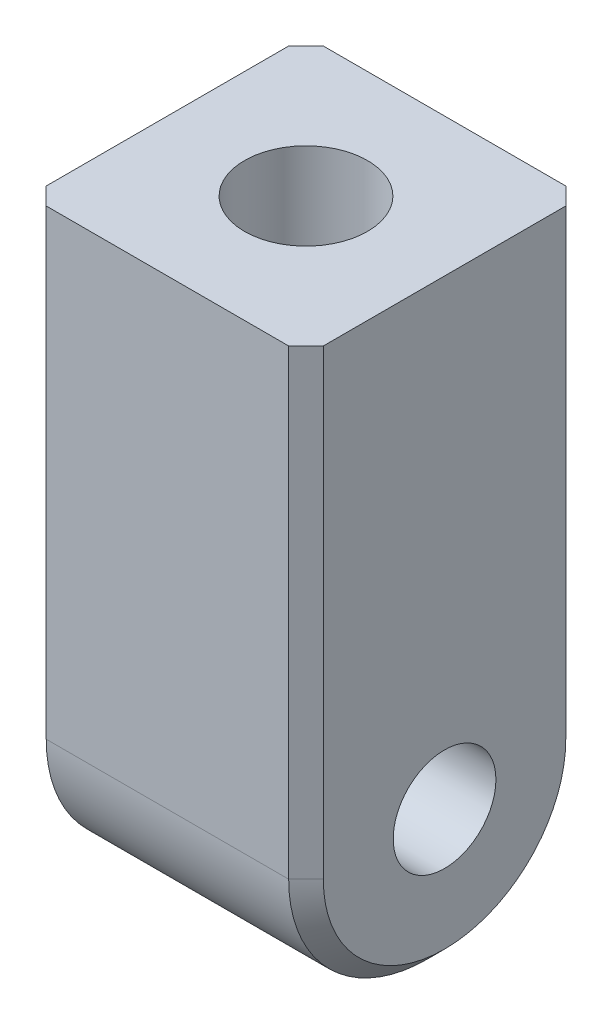
ISO-10303-21;
HEADER;
FILE_DESCRIPTION(('STEP AP214'),'2;1');
FILE_NAME('part.step','',(''),(''),'','','');
FILE_SCHEMA(('AUTOMOTIVE_DESIGN { 1 0 10303 214 1 1 1 1 }'));
ENDSEC;
DATA;
#1=APPLICATION_CONTEXT('core data for automotive mechanical design processes');
#2=APPLICATION_PROTOCOL_DEFINITION('international standard','automotive_design',2000,#1);
#3=PRODUCT_CONTEXT('',#1,'mechanical');
#4=PRODUCT('Part','Part','',(#3));
#5=PRODUCT_RELATED_PRODUCT_CATEGORY('part','',(#4));
#6=PRODUCT_DEFINITION_FORMATION('','',#4);
#7=PRODUCT_DEFINITION_CONTEXT('part definition',#1,'design');
#8=PRODUCT_DEFINITION('design','',#6,#7);
#9=PRODUCT_DEFINITION_SHAPE('','',#8);
#10=(LENGTH_UNIT() NAMED_UNIT(*) SI_UNIT(.MILLI.,.METRE.));
#11=(NAMED_UNIT(*) PLANE_ANGLE_UNIT() SI_UNIT($,.RADIAN.));
#12=(NAMED_UNIT(*) SI_UNIT($,.STERADIAN.) SOLID_ANGLE_UNIT());
#13=UNCERTAINTY_MEASURE_WITH_UNIT(LENGTH_MEASURE(1.E-05),#10,'distance_accuracy_value','');
#14=(GEOMETRIC_REPRESENTATION_CONTEXT(3) GLOBAL_UNCERTAINTY_ASSIGNED_CONTEXT((#13)) GLOBAL_UNIT_ASSIGNED_CONTEXT((#10,
#11,#12)) REPRESENTATION_CONTEXT('',''));
#15=CARTESIAN_POINT('',(0.,0.,0.));
#16=DIRECTION('',(0.,0.,1.));
#17=DIRECTION('',(1.,0.,0.));
#18=AXIS2_PLACEMENT_3D('',#15,#16,#17);
#19=CARTESIAN_POINT('',(3.048,13.208,3.048));
#20=DIRECTION('',(-1.,0.,0.));
#21=DIRECTION('',(0.,0.,1.));
#22=AXIS2_PLACEMENT_3D('',#19,#20,#21);
#23=PLANE('',#22);
#24=CARTESIAN_POINT('',(3.048,3.048,0.));
#25=DIRECTION('',(1.,0.,0.));
#26=DIRECTION('',(0.,0.,-1.));
#27=AXIS2_PLACEMENT_3D('',#24,#25,#26);
#28=CIRCLE('',#27,1.1303);
#29=CARTESIAN_POINT('',(3.048,3.048,-1.1303));
#30=VERTEX_POINT('',#29);
#31=EDGE_CURVE('E204',#30,#30,#28,.T.);
#32=ORIENTED_EDGE('',*,*,#31,.F.);
#33=EDGE_LOOP('',(#32));
#34=FACE_BOUND('',#33,.T.);
#35=CARTESIAN_POINT('',(3.048,3.048,0.));
#36=DIRECTION('',(-1.,0.,0.));
#37=DIRECTION('',(0.,0.,1.));
#38=AXIS2_PLACEMENT_3D('',#35,#36,#37);
#39=CIRCLE('',#38,2.667);
#40=CARTESIAN_POINT('',(3.048,0.381000000000003,0.));
#41=VERTEX_POINT('',#40);
#42=CARTESIAN_POINT('',(3.048,3.048,-2.667));
#43=VERTEX_POINT('',#42);
#44=EDGE_CURVE('E52',#41,#43,#39,.F.);
#45=ORIENTED_EDGE('',*,*,#44,.T.);
#46=DIRECTION('',(0.,1.,0.));
#47=VECTOR('',#46,1.);
#48=CARTESIAN_POINT('',(3.048,13.208,-2.667));
#49=LINE('',#48,#47);
#50=CARTESIAN_POINT('',(3.048,13.208,-2.667));
#51=VERTEX_POINT('',#50);
#52=EDGE_CURVE('E11',#43,#51,#49,.T.);
#53=ORIENTED_EDGE('',*,*,#52,.T.);
#54=DIRECTION('',(0.,0.,-1.));
#55=VECTOR('',#54,1.);
#56=CARTESIAN_POINT('',(3.048,13.208,3.048));
#57=LINE('',#56,#55);
#58=CARTESIAN_POINT('',(3.048,13.208,2.667));
#59=VERTEX_POINT('',#58);
#60=EDGE_CURVE('E134',#59,#51,#57,.T.);
#61=ORIENTED_EDGE('',*,*,#60,.F.);
#62=DIRECTION('',(0.,-1.,0.));
#63=VECTOR('',#62,1.);
#64=CARTESIAN_POINT('',(3.048,13.208,2.667));
#65=LINE('',#64,#63);
#66=CARTESIAN_POINT('',(3.048,3.048,2.667));
#67=VERTEX_POINT('',#66);
#68=EDGE_CURVE('E192',#59,#67,#65,.T.);
#69=ORIENTED_EDGE('',*,*,#68,.T.);
#70=CARTESIAN_POINT('',(3.048,3.048,0.));
#71=DIRECTION('',(-1.,0.,0.));
#72=DIRECTION('',(0.,0.,1.));
#73=AXIS2_PLACEMENT_3D('',#70,#71,#72);
#74=CIRCLE('',#73,2.667);
#75=EDGE_CURVE('E63',#67,#41,#74,.F.);
#76=ORIENTED_EDGE('',*,*,#75,.T.);
#77=EDGE_LOOP('',(#45,#53,#61,#69,#76));
#78=FACE_BOUND('',#77,.T.);
#79=ADVANCED_FACE('F42',(#34,#78),#23,.F.);
#80=CARTESIAN_POINT('',(-3.048,13.208,-3.048));
#81=DIRECTION('',(0.,0.,1.));
#82=DIRECTION('',(1.,0.,0.));
#83=AXIS2_PLACEMENT_3D('',#80,#81,#82);
#84=PLANE('',#83);
#85=DIRECTION('',(-1.,0.,0.));
#86=VECTOR('',#85,1.);
#87=CARTESIAN_POINT('',(-3.048,3.048,-3.048));
#88=LINE('',#87,#86);
#89=CARTESIAN_POINT('',(2.66699999999999,3.048,-3.048));
#90=VERTEX_POINT('',#89);
#91=CARTESIAN_POINT('',(-2.667,3.048,-3.048));
#92=VERTEX_POINT('',#91);
#93=EDGE_CURVE('E152',#90,#92,#88,.T.);
#94=ORIENTED_EDGE('',*,*,#93,.T.);
#95=DIRECTION('',(0.,1.,0.));
#96=VECTOR('',#95,1.);
#97=CARTESIAN_POINT('',(-2.667,13.208,-3.048));
#98=LINE('',#97,#96);
#99=CARTESIAN_POINT('',(-2.667,13.208,-3.048));
#100=VERTEX_POINT('',#99);
#101=EDGE_CURVE('E190',#92,#100,#98,.T.);
#102=ORIENTED_EDGE('',*,*,#101,.T.);
#103=DIRECTION('',(-1.,0.,0.));
#104=VECTOR('',#103,1.);
#105=CARTESIAN_POINT('',(-3.048,13.208,-3.048));
#106=LINE('',#105,#104);
#107=CARTESIAN_POINT('',(2.66699999999999,13.208,-3.048));
#108=VERTEX_POINT('',#107);
#109=EDGE_CURVE('E143',#108,#100,#106,.T.);
#110=ORIENTED_EDGE('',*,*,#109,.F.);
#111=DIRECTION('',(0.,-1.,0.));
#112=VECTOR('',#111,1.);
#113=CARTESIAN_POINT('',(2.66699999999999,13.208,-3.048));
#114=LINE('',#113,#112);
#115=EDGE_CURVE('E187',#108,#90,#114,.T.);
#116=ORIENTED_EDGE('',*,*,#115,.T.);
#117=EDGE_LOOP('',(#94,#102,#110,#116));
#118=FACE_BOUND('',#117,.T.);
#119=ADVANCED_FACE('F257',(#118),#84,.F.);
#120=CARTESIAN_POINT('',(-3.048,13.208,3.048));
#121=DIRECTION('',(1.,0.,0.));
#122=DIRECTION('',(0.,0.,-1.));
#123=AXIS2_PLACEMENT_3D('',#120,#121,#122);
#124=PLANE('',#123);
#125=CARTESIAN_POINT('',(-3.048,3.048,0.));
#126=DIRECTION('',(1.,0.,0.));
#127=DIRECTION('',(0.,0.,-1.));
#128=AXIS2_PLACEMENT_3D('',#125,#126,#127);
#129=CIRCLE('',#128,1.1303);
#130=CARTESIAN_POINT('',(-3.048,3.048,-1.1303));
#131=VERTEX_POINT('',#130);
#132=EDGE_CURVE('E137',#131,#131,#129,.T.);
#133=ORIENTED_EDGE('',*,*,#132,.T.);
#134=EDGE_LOOP('',(#133));
#135=FACE_BOUND('',#134,.T.);
#136=CARTESIAN_POINT('',(-3.048,3.048,0.));
#137=DIRECTION('',(1.,0.,0.));
#138=DIRECTION('',(0.,0.,-1.));
#139=AXIS2_PLACEMENT_3D('',#136,#137,#138);
#140=CIRCLE('',#139,2.667);
#141=CARTESIAN_POINT('',(-3.048,0.381000000000002,0.));
#142=VERTEX_POINT('',#141);
#143=CARTESIAN_POINT('',(-3.048,3.048,2.667));
#144=VERTEX_POINT('',#143);
#145=EDGE_CURVE('E167',#142,#144,#140,.F.);
#146=ORIENTED_EDGE('',*,*,#145,.T.);
#147=DIRECTION('',(0.,1.,0.));
#148=VECTOR('',#147,1.);
#149=CARTESIAN_POINT('',(-3.048,13.208,2.667));
#150=LINE('',#149,#148);
#151=CARTESIAN_POINT('',(-3.048,13.208,2.667));
#152=VERTEX_POINT('',#151);
#153=EDGE_CURVE('E169',#144,#152,#150,.T.);
#154=ORIENTED_EDGE('',*,*,#153,.T.);
#155=DIRECTION('',(0.,0.,1.));
#156=VECTOR('',#155,1.);
#157=CARTESIAN_POINT('',(-3.048,13.208,3.048));
#158=LINE('',#157,#156);
#159=CARTESIAN_POINT('',(-3.048,13.208,-2.667));
#160=VERTEX_POINT('',#159);
#161=EDGE_CURVE('E146',#160,#152,#158,.T.);
#162=ORIENTED_EDGE('',*,*,#161,.F.);
#163=DIRECTION('',(0.,-1.,0.));
#164=VECTOR('',#163,1.);
#165=CARTESIAN_POINT('',(-3.048,13.208,-2.667));
#166=LINE('',#165,#164);
#167=CARTESIAN_POINT('',(-3.048,3.048,-2.667));
#168=VERTEX_POINT('',#167);
#169=EDGE_CURVE('E163',#160,#168,#166,.T.);
#170=ORIENTED_EDGE('',*,*,#169,.T.);
#171=CARTESIAN_POINT('',(-3.048,3.048,0.));
#172=DIRECTION('',(1.,0.,0.));
#173=DIRECTION('',(0.,0.,-1.));
#174=AXIS2_PLACEMENT_3D('',#171,#172,#173);
#175=CIRCLE('',#174,2.667);
#176=EDGE_CURVE('E165',#168,#142,#175,.F.);
#177=ORIENTED_EDGE('',*,*,#176,.T.);
#178=EDGE_LOOP('',(#146,#154,#162,#170,#177));
#179=FACE_BOUND('',#178,.T.);
#180=ADVANCED_FACE('F249',(#135,#179),#124,.F.);
#181=CARTESIAN_POINT('',(-3.048,13.208,3.048));
#182=DIRECTION('',(0.,0.,-1.));
#183=DIRECTION('',(-1.,0.,0.));
#184=AXIS2_PLACEMENT_3D('',#181,#182,#183);
#185=PLANE('',#184);
#186=DIRECTION('',(1.,0.,0.));
#187=VECTOR('',#186,1.);
#188=CARTESIAN_POINT('',(-3.048,13.208,3.048));
#189=LINE('',#188,#187);
#190=CARTESIAN_POINT('',(-2.667,13.208,3.048));
#191=VERTEX_POINT('',#190);
#192=CARTESIAN_POINT('',(2.66699999999999,13.208,3.048));
#193=VERTEX_POINT('',#192);
#194=EDGE_CURVE('E149',#191,#193,#189,.T.);
#195=ORIENTED_EDGE('',*,*,#194,.F.);
#196=DIRECTION('',(0.,-1.,0.));
#197=VECTOR('',#196,1.);
#198=CARTESIAN_POINT('',(-2.667,13.208,3.048));
#199=LINE('',#198,#197);
#200=CARTESIAN_POINT('',(-2.667,3.048,3.048));
#201=VERTEX_POINT('',#200);
#202=EDGE_CURVE('E160',#191,#201,#199,.T.);
#203=ORIENTED_EDGE('',*,*,#202,.T.);
#204=DIRECTION('',(1.,0.,0.));
#205=VECTOR('',#204,1.);
#206=CARTESIAN_POINT('',(3.048,3.048,3.048));
#207=LINE('',#206,#205);
#208=CARTESIAN_POINT('',(2.66699999999999,3.048,3.048));
#209=VERTEX_POINT('',#208);
#210=EDGE_CURVE('E155',#201,#209,#207,.T.);
#211=ORIENTED_EDGE('',*,*,#210,.T.);
#212=DIRECTION('',(0.,1.,0.));
#213=VECTOR('',#212,1.);
#214=CARTESIAN_POINT('',(2.66699999999999,13.208,3.048));
#215=LINE('',#214,#213);
#216=EDGE_CURVE('E157',#209,#193,#215,.T.);
#217=ORIENTED_EDGE('',*,*,#216,.T.);
#218=EDGE_LOOP('',(#195,#203,#211,#217));
#219=FACE_BOUND('',#218,.T.);
#220=ADVANCED_FACE('F221',(#219),#185,.F.);
#221=CARTESIAN_POINT('',(0.,13.208,0.));
#222=DIRECTION('',(0.,-1.,0.));
#223=DIRECTION('',(0.,0.,-1.));
#224=AXIS2_PLACEMENT_3D('',#221,#222,#223);
#225=PLANE('',#224);
#226=CARTESIAN_POINT('',(0.,13.208,0.));
#227=DIRECTION('',(0.,1.,0.));
#228=DIRECTION('',(0.,0.,1.));
#229=AXIS2_PLACEMENT_3D('',#226,#227,#228);
#230=CIRCLE('',#229,1.35255);
#231=CARTESIAN_POINT('',(0.,13.208,1.35255));
#232=VERTEX_POINT('',#231);
#233=EDGE_CURVE('E131',#232,#232,#230,.T.);
#234=ORIENTED_EDGE('',*,*,#233,.F.);
#235=EDGE_LOOP('',(#234));
#236=FACE_BOUND('',#235,.T.);
#237=ORIENTED_EDGE('',*,*,#161,.T.);
#238=DIRECTION('',(-0.707106781186549,0.,-0.707106781186546));
#239=VECTOR('',#238,1.);
#240=CARTESIAN_POINT('',(-2.667,13.208,3.048));
#241=LINE('',#240,#239);
#242=EDGE_CURVE('E177',#152,#191,#241,.F.);
#243=ORIENTED_EDGE('',*,*,#242,.T.);
#244=ORIENTED_EDGE('',*,*,#194,.T.);
#245=DIRECTION('',(-0.707106781186549,0.,0.707106781186546));
#246=VECTOR('',#245,1.);
#247=CARTESIAN_POINT('',(3.048,13.208,2.667));
#248=LINE('',#247,#246);
#249=EDGE_CURVE('E171',#193,#59,#248,.F.);
#250=ORIENTED_EDGE('',*,*,#249,.T.);
#251=ORIENTED_EDGE('',*,*,#60,.T.);
#252=DIRECTION('',(0.707106781186549,0.,0.707106781186546));
#253=VECTOR('',#252,1.);
#254=CARTESIAN_POINT('',(2.66699999999999,13.208,-3.048));
#255=LINE('',#254,#253);
#256=EDGE_CURVE('E173',#51,#108,#255,.F.);
#257=ORIENTED_EDGE('',*,*,#256,.T.);
#258=ORIENTED_EDGE('',*,*,#109,.T.);
#259=DIRECTION('',(0.707106781186549,0.,-0.707106781186546));
#260=VECTOR('',#259,1.);
#261=CARTESIAN_POINT('',(-3.048,13.208,-2.667));
#262=LINE('',#261,#260);
#263=EDGE_CURVE('E175',#100,#160,#262,.F.);
#264=ORIENTED_EDGE('',*,*,#263,.T.);
#265=EDGE_LOOP('',(#237,#243,#244,#250,#251,#257,#258,#264));
#266=FACE_BOUND('',#265,.T.);
#267=ADVANCED_FACE('F225',(#236,#266),#225,.F.);
#268=CARTESIAN_POINT('',(-3.048,3.048,0.));
#269=DIRECTION('',(-1.,0.,0.));
#270=DIRECTION('',(0.,0.,1.));
#271=AXIS2_PLACEMENT_3D('',#268,#269,#270);
#272=CYLINDRICAL_SURFACE('',#271,3.048);
#273=ORIENTED_EDGE('',*,*,#210,.F.);
#274=CARTESIAN_POINT('',(-2.667,3.048,0.));
#275=DIRECTION('',(1.,0.,0.));
#276=DIRECTION('',(0.,0.,-1.));
#277=AXIS2_PLACEMENT_3D('',#274,#275,#276);
#278=CIRCLE('',#277,3.048);
#279=CARTESIAN_POINT('',(-2.667,0.,0.));
#280=VERTEX_POINT('',#279);
#281=EDGE_CURVE('E181',#201,#280,#278,.T.);
#282=ORIENTED_EDGE('',*,*,#281,.T.);
#283=DIRECTION('',(1.,0.,0.));
#284=VECTOR('',#283,1.);
#285=CARTESIAN_POINT('',(-3.048,0.,0.));
#286=LINE('',#285,#284);
#287=CARTESIAN_POINT('',(2.66699999999999,0.,0.));
#288=VERTEX_POINT('',#287);
#289=EDGE_CURVE('E130',#288,#280,#286,.F.);
#290=ORIENTED_EDGE('',*,*,#289,.F.);
#291=CARTESIAN_POINT('',(2.66699999999999,3.048,0.));
#292=DIRECTION('',(-1.,0.,0.));
#293=DIRECTION('',(0.,0.,1.));
#294=AXIS2_PLACEMENT_3D('',#291,#292,#293);
#295=CIRCLE('',#294,3.048);
#296=EDGE_CURVE('E179',#288,#209,#295,.T.);
#297=ORIENTED_EDGE('',*,*,#296,.T.);
#298=EDGE_LOOP('',(#273,#282,#290,#297));
#299=FACE_BOUND('',#298,.T.);
#300=ADVANCED_FACE('F235',(#299),#272,.T.);
#301=CARTESIAN_POINT('',(-3.048,3.048,0.));
#302=DIRECTION('',(1.,0.,0.));
#303=DIRECTION('',(0.,0.,-1.));
#304=AXIS2_PLACEMENT_3D('',#301,#302,#303);
#305=CYLINDRICAL_SURFACE('',#304,3.048);
#306=ORIENTED_EDGE('',*,*,#289,.T.);
#307=CARTESIAN_POINT('',(-2.667,3.048,0.));
#308=DIRECTION('',(1.,0.,0.));
#309=DIRECTION('',(0.,0.,-1.));
#310=AXIS2_PLACEMENT_3D('',#307,#308,#309);
#311=CIRCLE('',#310,3.048);
#312=EDGE_CURVE('E185',#280,#92,#311,.T.);
#313=ORIENTED_EDGE('',*,*,#312,.T.);
#314=ORIENTED_EDGE('',*,*,#93,.F.);
#315=CARTESIAN_POINT('',(2.66699999999999,3.048,0.));
#316=DIRECTION('',(-1.,0.,0.));
#317=DIRECTION('',(0.,0.,1.));
#318=AXIS2_PLACEMENT_3D('',#315,#316,#317);
#319=CIRCLE('',#318,3.048);
#320=EDGE_CURVE('E183',#90,#288,#319,.T.);
#321=ORIENTED_EDGE('',*,*,#320,.T.);
#322=EDGE_LOOP('',(#306,#313,#314,#321));
#323=FACE_BOUND('',#322,.T.);
#324=ADVANCED_FACE('F124',(#323),#305,.T.);
#325=CARTESIAN_POINT('',(0.,5.588,0.));
#326=DIRECTION('',(0.,1.,0.));
#327=DIRECTION('',(0.,0.,1.));
#328=AXIS2_PLACEMENT_3D('',#325,#326,#327);
#329=CONICAL_SURFACE('',#328,1.35255,1.02974425867665);
#330=CARTESIAN_POINT('',(0.,4.77530596973427,0.));
#331=VERTEX_POINT('',#330);
#332=VERTEX_LOOP('',#331);
#333=FACE_BOUND('',#332,.T.);
#334=CARTESIAN_POINT('',(0.,5.588,0.));
#335=DIRECTION('',(0.,1.,0.));
#336=DIRECTION('',(0.,0.,1.));
#337=AXIS2_PLACEMENT_3D('',#334,#335,#336);
#338=CIRCLE('',#337,1.35255);
#339=CARTESIAN_POINT('',(0.,5.588,1.35255));
#340=VERTEX_POINT('',#339);
#341=EDGE_CURVE('E128',#340,#340,#338,.T.);
#342=ORIENTED_EDGE('',*,*,#341,.T.);
#343=EDGE_LOOP('',(#342));
#344=FACE_BOUND('',#343,.T.);
#345=ADVANCED_FACE('F120',(#333,#344),#329,.F.);
#346=CARTESIAN_POINT('',(0.,13.208,0.));
#347=DIRECTION('',(0.,1.,0.));
#348=DIRECTION('',(0.,0.,1.));
#349=AXIS2_PLACEMENT_3D('',#346,#347,#348);
#350=CYLINDRICAL_SURFACE('',#349,1.35255);
#351=ORIENTED_EDGE('',*,*,#341,.F.);
#352=EDGE_LOOP('',(#351));
#353=FACE_BOUND('',#352,.T.);
#354=ORIENTED_EDGE('',*,*,#233,.T.);
#355=EDGE_LOOP('',(#354));
#356=FACE_BOUND('',#355,.T.);
#357=ADVANCED_FACE('F123',(#353,#356),#350,.F.);
#358=CARTESIAN_POINT('',(3.048,3.048,0.));
#359=DIRECTION('',(1.,0.,0.));
#360=DIRECTION('',(0.,0.,-1.));
#361=AXIS2_PLACEMENT_3D('',#358,#359,#360);
#362=CYLINDRICAL_SURFACE('',#361,1.1303);
#363=ORIENTED_EDGE('',*,*,#132,.F.);
#364=EDGE_LOOP('',(#363));
#365=FACE_BOUND('',#364,.T.);
#366=ORIENTED_EDGE('',*,*,#31,.T.);
#367=EDGE_LOOP('',(#366));
#368=FACE_BOUND('',#367,.T.);
#369=ADVANCED_FACE('F305',(#365,#368),#362,.F.);
#370=CARTESIAN_POINT('',(-3.048,13.208,-2.667));
#371=DIRECTION('',(0.707106781186546,0.,0.707106781186549));
#372=DIRECTION('',(0.,-1.,0.));
#373=AXIS2_PLACEMENT_3D('',#370,#371,#372);
#374=PLANE('',#373);
#375=ORIENTED_EDGE('',*,*,#263,.F.);
#376=ORIENTED_EDGE('',*,*,#101,.F.);
#377=DIRECTION('',(0.707106781186549,0.,-0.707106781186546));
#378=VECTOR('',#377,1.);
#379=CARTESIAN_POINT('',(-3.048,3.048,-2.667));
#380=LINE('',#379,#378);
#381=EDGE_CURVE('E201',#168,#92,#380,.T.);
#382=ORIENTED_EDGE('',*,*,#381,.F.);
#383=ORIENTED_EDGE('',*,*,#169,.F.);
#384=EDGE_LOOP('',(#375,#376,#382,#383));
#385=FACE_BOUND('',#384,.T.);
#386=ADVANCED_FACE('F254',(#385),#374,.F.);
#387=CARTESIAN_POINT('',(-3.048,3.048,0.));
#388=DIRECTION('',(1.,0.,0.));
#389=DIRECTION('',(0.,0.,-1.));
#390=AXIS2_PLACEMENT_3D('',#387,#388,#389);
#391=CONICAL_SURFACE('',#390,2.667,0.785398163397446);
#392=ORIENTED_EDGE('',*,*,#381,.T.);
#393=ORIENTED_EDGE('',*,*,#312,.F.);
#394=DIRECTION('',(0.707106781186549,-0.707106781186546,0.));
#395=VECTOR('',#394,1.);
#396=CARTESIAN_POINT('',(-3.048,0.381000000000002,0.));
#397=LINE('',#396,#395);
#398=EDGE_CURVE('E198',#142,#280,#397,.T.);
#399=ORIENTED_EDGE('',*,*,#398,.F.);
#400=ORIENTED_EDGE('',*,*,#176,.F.);
#401=EDGE_LOOP('',(#392,#393,#399,#400));
#402=FACE_BOUND('',#401,.T.);
#403=ADVANCED_FACE('F242',(#402),#391,.T.);
#404=CARTESIAN_POINT('',(-3.048,3.048,0.));
#405=DIRECTION('',(1.,0.,0.));
#406=DIRECTION('',(0.,0.,-1.));
#407=AXIS2_PLACEMENT_3D('',#404,#405,#406);
#408=CONICAL_SURFACE('',#407,2.667,0.785398163397446);
#409=ORIENTED_EDGE('',*,*,#398,.T.);
#410=ORIENTED_EDGE('',*,*,#281,.F.);
#411=DIRECTION('',(0.707106781186549,0.,0.707106781186546));
#412=VECTOR('',#411,1.);
#413=CARTESIAN_POINT('',(-3.048,3.048,2.667));
#414=LINE('',#413,#412);
#415=EDGE_CURVE('E196',#144,#201,#414,.T.);
#416=ORIENTED_EDGE('',*,*,#415,.F.);
#417=ORIENTED_EDGE('',*,*,#145,.F.);
#418=EDGE_LOOP('',(#409,#410,#416,#417));
#419=FACE_BOUND('',#418,.T.);
#420=ADVANCED_FACE('F247',(#419),#408,.T.);
#421=CARTESIAN_POINT('',(-2.667,13.208,3.048));
#422=DIRECTION('',(0.707106781186546,0.,-0.707106781186549));
#423=DIRECTION('',(0.,-1.,0.));
#424=AXIS2_PLACEMENT_3D('',#421,#422,#423);
#425=PLANE('',#424);
#426=ORIENTED_EDGE('',*,*,#242,.F.);
#427=ORIENTED_EDGE('',*,*,#153,.F.);
#428=ORIENTED_EDGE('',*,*,#415,.T.);
#429=ORIENTED_EDGE('',*,*,#202,.F.);
#430=EDGE_LOOP('',(#426,#427,#428,#429));
#431=FACE_BOUND('',#430,.T.);
#432=ADVANCED_FACE('F231',(#431),#425,.F.);
#433=CARTESIAN_POINT('',(3.048,13.208,2.667));
#434=DIRECTION('',(-0.707106781186546,0.,-0.707106781186549));
#435=DIRECTION('',(0.,-1.,0.));
#436=AXIS2_PLACEMENT_3D('',#433,#434,#435);
#437=PLANE('',#436);
#438=ORIENTED_EDGE('',*,*,#249,.F.);
#439=ORIENTED_EDGE('',*,*,#216,.F.);
#440=DIRECTION('',(-0.707106781186549,0.,0.707106781186546));
#441=VECTOR('',#440,1.);
#442=CARTESIAN_POINT('',(3.048,3.048,2.667));
#443=LINE('',#442,#441);
#444=EDGE_CURVE('E47',#67,#209,#443,.T.);
#445=ORIENTED_EDGE('',*,*,#444,.F.);
#446=ORIENTED_EDGE('',*,*,#68,.F.);
#447=EDGE_LOOP('',(#438,#439,#445,#446));
#448=FACE_BOUND('',#447,.T.);
#449=ADVANCED_FACE('F45',(#448),#437,.F.);
#450=CARTESIAN_POINT('',(3.048,3.048,0.));
#451=DIRECTION('',(-1.,0.,0.));
#452=DIRECTION('',(0.,0.,1.));
#453=AXIS2_PLACEMENT_3D('',#450,#451,#452);
#454=CONICAL_SURFACE('',#453,2.667,0.785398163397446);
#455=ORIENTED_EDGE('',*,*,#444,.T.);
#456=ORIENTED_EDGE('',*,*,#296,.F.);
#457=DIRECTION('',(-0.707106781186549,-0.707106781186546,0.));
#458=VECTOR('',#457,1.);
#459=CARTESIAN_POINT('',(3.048,0.381000000000003,0.));
#460=LINE('',#459,#458);
#461=EDGE_CURVE('E206',#41,#288,#460,.T.);
#462=ORIENTED_EDGE('',*,*,#461,.F.);
#463=ORIENTED_EDGE('',*,*,#75,.F.);
#464=EDGE_LOOP('',(#455,#456,#462,#463));
#465=FACE_BOUND('',#464,.T.);
#466=ADVANCED_FACE('F214',(#465),#454,.T.);
#467=CARTESIAN_POINT('',(3.048,3.048,0.));
#468=DIRECTION('',(-1.,0.,0.));
#469=DIRECTION('',(0.,0.,1.));
#470=AXIS2_PLACEMENT_3D('',#467,#468,#469);
#471=CONICAL_SURFACE('',#470,2.667,0.785398163397446);
#472=ORIENTED_EDGE('',*,*,#461,.T.);
#473=ORIENTED_EDGE('',*,*,#320,.F.);
#474=DIRECTION('',(-0.707106781186549,0.,-0.707106781186546));
#475=VECTOR('',#474,1.);
#476=CARTESIAN_POINT('',(3.048,3.048,-2.667));
#477=LINE('',#476,#475);
#478=EDGE_CURVE('E205',#43,#90,#477,.T.);
#479=ORIENTED_EDGE('',*,*,#478,.F.);
#480=ORIENTED_EDGE('',*,*,#44,.F.);
#481=EDGE_LOOP('',(#472,#473,#479,#480));
#482=FACE_BOUND('',#481,.T.);
#483=ADVANCED_FACE('F263',(#482),#471,.T.);
#484=CARTESIAN_POINT('',(2.66699999999999,13.208,-3.048));
#485=DIRECTION('',(-0.707106781186546,0.,0.707106781186549));
#486=DIRECTION('',(0.,-1.,0.));
#487=AXIS2_PLACEMENT_3D('',#484,#485,#486);
#488=PLANE('',#487);
#489=ORIENTED_EDGE('',*,*,#256,.F.);
#490=ORIENTED_EDGE('',*,*,#52,.F.);
#491=ORIENTED_EDGE('',*,*,#478,.T.);
#492=ORIENTED_EDGE('',*,*,#115,.F.);
#493=EDGE_LOOP('',(#489,#490,#491,#492));
#494=FACE_BOUND('',#493,.T.);
#495=ADVANCED_FACE('F261',(#494),#488,.F.);
#496=CLOSED_SHELL('',(#79,#119,#180,#220,#267,#300,#324,#345,#357,#369,#386,#403,#420,#432,#449,
#466,#483,#495));
#497=MANIFOLD_SOLID_BREP('B2',#496);
#498=ADVANCED_BREP_SHAPE_REPRESENTATION('',(#18,#497),#14);
#499=SHAPE_DEFINITION_REPRESENTATION(#9,#498);
ENDSEC;
END-ISO-10303-21;
